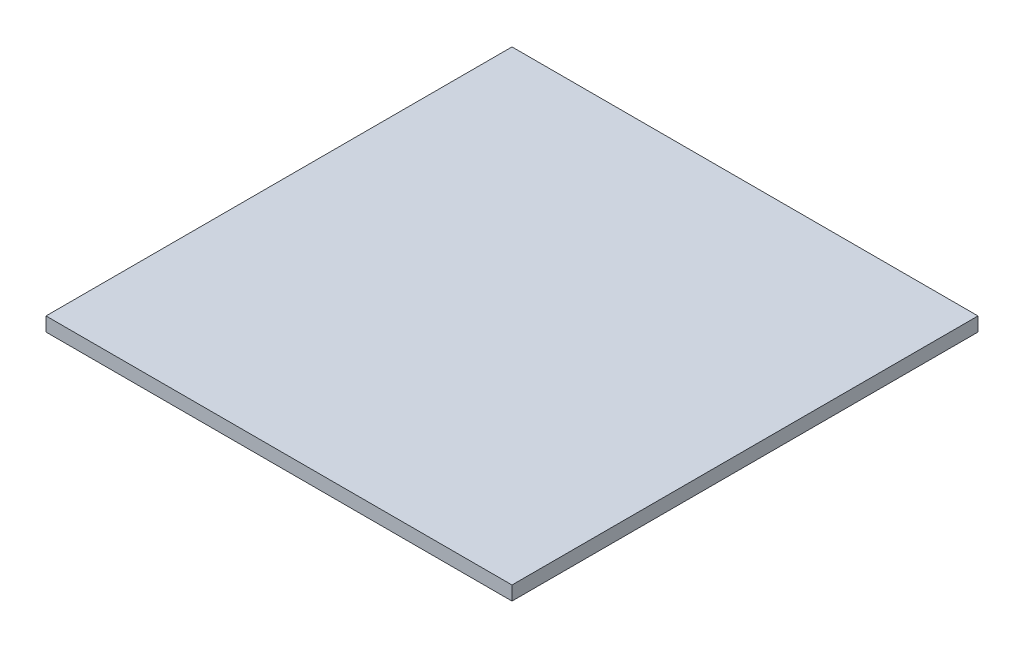
ISO-10303-21;
HEADER;
FILE_DESCRIPTION(('STEP AP214'),'2;1');
FILE_NAME('part.step','',(''),(''),'','','');
FILE_SCHEMA(('AUTOMOTIVE_DESIGN { 1 0 10303 214 1 1 1 1 }'));
ENDSEC;
DATA;
#1=APPLICATION_CONTEXT('core data for automotive mechanical design processes');
#2=APPLICATION_PROTOCOL_DEFINITION('international standard','automotive_design',2000,#1);
#3=PRODUCT_CONTEXT('',#1,'mechanical');
#4=PRODUCT('Part','Part','',(#3));
#5=PRODUCT_RELATED_PRODUCT_CATEGORY('part','',(#4));
#6=PRODUCT_DEFINITION_FORMATION('','',#4);
#7=PRODUCT_DEFINITION_CONTEXT('part definition',#1,'design');
#8=PRODUCT_DEFINITION('design','',#6,#7);
#9=PRODUCT_DEFINITION_SHAPE('','',#8);
#10=(LENGTH_UNIT() NAMED_UNIT(*) SI_UNIT(.MILLI.,.METRE.));
#11=(NAMED_UNIT(*) PLANE_ANGLE_UNIT() SI_UNIT($,.RADIAN.));
#12=(NAMED_UNIT(*) SI_UNIT($,.STERADIAN.) SOLID_ANGLE_UNIT());
#13=UNCERTAINTY_MEASURE_WITH_UNIT(LENGTH_MEASURE(1.E-05),#10,'distance_accuracy_value','');
#14=(GEOMETRIC_REPRESENTATION_CONTEXT(3) GLOBAL_UNCERTAINTY_ASSIGNED_CONTEXT((#13)) GLOBAL_UNIT_ASSIGNED_CONTEXT((#10,
#11,#12)) REPRESENTATION_CONTEXT('',''));
#15=CARTESIAN_POINT('',(0.,0.,0.));
#16=DIRECTION('',(0.,0.,1.));
#17=DIRECTION('',(1.,0.,0.));
#18=AXIS2_PLACEMENT_3D('',#15,#16,#17);
#19=CARTESIAN_POINT('',(0.,0.,0.));
#20=DIRECTION('',(0.,-1.,0.));
#21=DIRECTION('',(0.,0.,-1.));
#22=AXIS2_PLACEMENT_3D('',#19,#20,#21);
#23=PLANE('',#22);
#24=DIRECTION('',(0.,0.,-1.));
#25=VECTOR('',#24,1.);
#26=CARTESIAN_POINT('',(50.,0.,50.));
#27=LINE('',#26,#25);
#28=CARTESIAN_POINT('',(50.,0.,50.));
#29=VERTEX_POINT('',#28);
#30=CARTESIAN_POINT('',(50.,0.,-50.));
#31=VERTEX_POINT('',#30);
#32=EDGE_CURVE('E88',#29,#31,#27,.T.);
#33=ORIENTED_EDGE('',*,*,#32,.F.);
#34=DIRECTION('',(1.,0.,0.));
#35=VECTOR('',#34,1.);
#36=CARTESIAN_POINT('',(-50.,0.,50.));
#37=LINE('',#36,#35);
#38=CARTESIAN_POINT('',(-50.,0.,50.));
#39=VERTEX_POINT('',#38);
#40=EDGE_CURVE('E27',#39,#29,#37,.T.);
#41=ORIENTED_EDGE('',*,*,#40,.F.);
#42=DIRECTION('',(0.,0.,1.));
#43=VECTOR('',#42,1.);
#44=CARTESIAN_POINT('',(-50.,0.,50.));
#45=LINE('',#44,#43);
#46=CARTESIAN_POINT('',(-50.,0.,-50.));
#47=VERTEX_POINT('',#46);
#48=EDGE_CURVE('E77',#47,#39,#45,.T.);
#49=ORIENTED_EDGE('',*,*,#48,.F.);
#50=DIRECTION('',(-1.,0.,0.));
#51=VECTOR('',#50,1.);
#52=CARTESIAN_POINT('',(-50.,0.,-50.));
#53=LINE('',#52,#51);
#54=EDGE_CURVE('E102',#31,#47,#53,.T.);
#55=ORIENTED_EDGE('',*,*,#54,.F.);
#56=EDGE_LOOP('',(#33,#41,#49,#55));
#57=FACE_BOUND('',#56,.T.);
#58=ADVANCED_FACE('F16',(#57),#23,.T.);
#59=CARTESIAN_POINT('',(0.,3.,0.));
#60=DIRECTION('',(0.,-1.,0.));
#61=DIRECTION('',(0.,0.,-1.));
#62=AXIS2_PLACEMENT_3D('',#59,#60,#61);
#63=PLANE('',#62);
#64=DIRECTION('',(0.,0.,-1.));
#65=VECTOR('',#64,1.);
#66=CARTESIAN_POINT('',(50.,3.,50.));
#67=LINE('',#66,#65);
#68=CARTESIAN_POINT('',(50.,3.,50.));
#69=VERTEX_POINT('',#68);
#70=CARTESIAN_POINT('',(50.,3.,-50.));
#71=VERTEX_POINT('',#70);
#72=EDGE_CURVE('E79',#69,#71,#67,.T.);
#73=ORIENTED_EDGE('',*,*,#72,.T.);
#74=DIRECTION('',(-1.,0.,0.));
#75=VECTOR('',#74,1.);
#76=CARTESIAN_POINT('',(-50.,3.,-50.));
#77=LINE('',#76,#75);
#78=CARTESIAN_POINT('',(-50.,3.,-50.));
#79=VERTEX_POINT('',#78);
#80=EDGE_CURVE('E20',#71,#79,#77,.T.);
#81=ORIENTED_EDGE('',*,*,#80,.T.);
#82=DIRECTION('',(0.,0.,1.));
#83=VECTOR('',#82,1.);
#84=CARTESIAN_POINT('',(-50.,3.,50.));
#85=LINE('',#84,#83);
#86=CARTESIAN_POINT('',(-50.,3.,50.));
#87=VERTEX_POINT('',#86);
#88=EDGE_CURVE('E98',#79,#87,#85,.T.);
#89=ORIENTED_EDGE('',*,*,#88,.T.);
#90=DIRECTION('',(1.,0.,0.));
#91=VECTOR('',#90,1.);
#92=CARTESIAN_POINT('',(-50.,3.,50.));
#93=LINE('',#92,#91);
#94=EDGE_CURVE('E10',#87,#69,#93,.T.);
#95=ORIENTED_EDGE('',*,*,#94,.T.);
#96=EDGE_LOOP('',(#73,#81,#89,#95));
#97=FACE_BOUND('',#96,.T.);
#98=ADVANCED_FACE('F80',(#97),#63,.F.);
#99=CARTESIAN_POINT('',(-50.,3.,50.));
#100=DIRECTION('',(0.,0.,-1.));
#101=DIRECTION('',(0.,-1.,0.));
#102=AXIS2_PLACEMENT_3D('',#99,#100,#101);
#103=PLANE('',#102);
#104=ORIENTED_EDGE('',*,*,#40,.T.);
#105=DIRECTION('',(0.,-1.,0.));
#106=VECTOR('',#105,1.);
#107=CARTESIAN_POINT('',(50.,3.,50.));
#108=LINE('',#107,#106);
#109=EDGE_CURVE('E84',#69,#29,#108,.T.);
#110=ORIENTED_EDGE('',*,*,#109,.F.);
#111=ORIENTED_EDGE('',*,*,#94,.F.);
#112=DIRECTION('',(0.,-1.,0.));
#113=VECTOR('',#112,1.);
#114=CARTESIAN_POINT('',(-50.,3.,50.));
#115=LINE('',#114,#113);
#116=EDGE_CURVE('E99',#87,#39,#115,.T.);
#117=ORIENTED_EDGE('',*,*,#116,.T.);
#118=EDGE_LOOP('',(#104,#110,#111,#117));
#119=FACE_BOUND('',#118,.T.);
#120=ADVANCED_FACE('F123',(#119),#103,.F.);
#121=CARTESIAN_POINT('',(-50.,3.,50.));
#122=DIRECTION('',(1.,0.,0.));
#123=DIRECTION('',(0.,1.,0.));
#124=AXIS2_PLACEMENT_3D('',#121,#122,#123);
#125=PLANE('',#124);
#126=ORIENTED_EDGE('',*,*,#48,.T.);
#127=ORIENTED_EDGE('',*,*,#116,.F.);
#128=ORIENTED_EDGE('',*,*,#88,.F.);
#129=DIRECTION('',(0.,-1.,0.));
#130=VECTOR('',#129,1.);
#131=CARTESIAN_POINT('',(-50.,3.,-50.));
#132=LINE('',#131,#130);
#133=EDGE_CURVE('E74',#79,#47,#132,.T.);
#134=ORIENTED_EDGE('',*,*,#133,.T.);
#135=EDGE_LOOP('',(#126,#127,#128,#134));
#136=FACE_BOUND('',#135,.T.);
#137=ADVANCED_FACE('F124',(#136),#125,.F.);
#138=CARTESIAN_POINT('',(-50.,3.,-50.));
#139=DIRECTION('',(0.,0.,1.));
#140=DIRECTION('',(1.,0.,0.));
#141=AXIS2_PLACEMENT_3D('',#138,#139,#140);
#142=PLANE('',#141);
#143=ORIENTED_EDGE('',*,*,#54,.T.);
#144=ORIENTED_EDGE('',*,*,#133,.F.);
#145=ORIENTED_EDGE('',*,*,#80,.F.);
#146=DIRECTION('',(0.,-1.,0.));
#147=VECTOR('',#146,1.);
#148=CARTESIAN_POINT('',(50.,3.,-50.));
#149=LINE('',#148,#147);
#150=EDGE_CURVE('E71',#71,#31,#149,.T.);
#151=ORIENTED_EDGE('',*,*,#150,.T.);
#152=EDGE_LOOP('',(#143,#144,#145,#151));
#153=FACE_BOUND('',#152,.T.);
#154=ADVANCED_FACE('F18',(#153),#142,.F.);
#155=CARTESIAN_POINT('',(50.,3.,50.));
#156=DIRECTION('',(-1.,0.,0.));
#157=DIRECTION('',(0.,0.,1.));
#158=AXIS2_PLACEMENT_3D('',#155,#156,#157);
#159=PLANE('',#158);
#160=ORIENTED_EDGE('',*,*,#32,.T.);
#161=ORIENTED_EDGE('',*,*,#150,.F.);
#162=ORIENTED_EDGE('',*,*,#72,.F.);
#163=ORIENTED_EDGE('',*,*,#109,.T.);
#164=EDGE_LOOP('',(#160,#161,#162,#163));
#165=FACE_BOUND('',#164,.T.);
#166=ADVANCED_FACE('F86',(#165),#159,.F.);
#167=CLOSED_SHELL('',(#58,#98,#120,#137,#154,#166));
#168=MANIFOLD_SOLID_BREP('B1',#167);
#169=ADVANCED_BREP_SHAPE_REPRESENTATION('',(#18,#168),#14);
#170=SHAPE_DEFINITION_REPRESENTATION(#9,#169);
ENDSEC;
END-ISO-10303-21;
